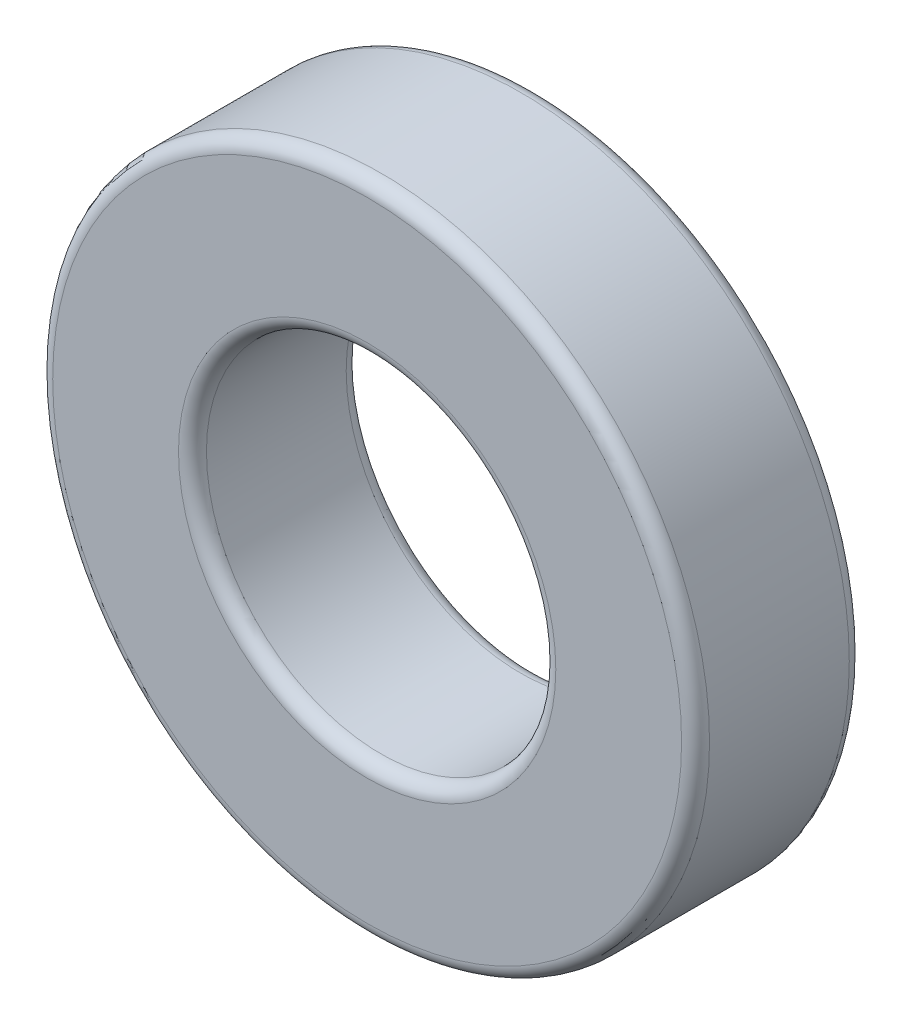
ISO-10303-21;
HEADER;
FILE_DESCRIPTION(('STEP AP214'),'2;1');
FILE_NAME('part.step','',(''),(''),'','','');
FILE_SCHEMA(('AUTOMOTIVE_DESIGN { 1 0 10303 214 1 1 1 1 }'));
ENDSEC;
DATA;
#1=APPLICATION_CONTEXT('core data for automotive mechanical design processes');
#2=APPLICATION_PROTOCOL_DEFINITION('international standard','automotive_design',2000,#1);
#3=PRODUCT_CONTEXT('',#1,'mechanical');
#4=PRODUCT('Part','Part','',(#3));
#5=PRODUCT_RELATED_PRODUCT_CATEGORY('part','',(#4));
#6=PRODUCT_DEFINITION_FORMATION('','',#4);
#7=PRODUCT_DEFINITION_CONTEXT('part definition',#1,'design');
#8=PRODUCT_DEFINITION('design','',#6,#7);
#9=PRODUCT_DEFINITION_SHAPE('','',#8);
#10=(LENGTH_UNIT() NAMED_UNIT(*) SI_UNIT(.MILLI.,.METRE.));
#11=(NAMED_UNIT(*) PLANE_ANGLE_UNIT() SI_UNIT($,.RADIAN.));
#12=(NAMED_UNIT(*) SI_UNIT($,.STERADIAN.) SOLID_ANGLE_UNIT());
#13=UNCERTAINTY_MEASURE_WITH_UNIT(LENGTH_MEASURE(1.E-05),#10,'distance_accuracy_value','');
#14=(GEOMETRIC_REPRESENTATION_CONTEXT(3) GLOBAL_UNCERTAINTY_ASSIGNED_CONTEXT((#13)) GLOBAL_UNIT_ASSIGNED_CONTEXT((#10,
#11,#12)) REPRESENTATION_CONTEXT('',''));
#15=CARTESIAN_POINT('',(0.,0.,0.));
#16=DIRECTION('',(0.,0.,1.));
#17=DIRECTION('',(1.,0.,0.));
#18=AXIS2_PLACEMENT_3D('',#15,#16,#17);
#19=CARTESIAN_POINT('',(0.,0.,12.));
#20=DIRECTION('',(0.,0.,1.));
#21=DIRECTION('',(1.,0.,0.));
#22=AXIS2_PLACEMENT_3D('',#19,#20,#21);
#23=PLANE('',#22);
#24=CARTESIAN_POINT('',(0.,0.,12.));
#25=DIRECTION('',(0.,0.,1.));
#26=DIRECTION('',(1.,0.,0.));
#27=AXIS2_PLACEMENT_3D('',#24,#25,#26);
#28=CIRCLE('',#27,13.5);
#29=CARTESIAN_POINT('',(13.5,0.,12.));
#30=VERTEX_POINT('',#29);
#31=EDGE_CURVE('E42',#30,#30,#28,.F.);
#32=ORIENTED_EDGE('',*,*,#31,.T.);
#33=EDGE_LOOP('',(#32));
#34=FACE_BOUND('',#33,.T.);
#35=CARTESIAN_POINT('',(0.,0.,12.));
#36=DIRECTION('',(0.,0.,1.));
#37=DIRECTION('',(1.,0.,0.));
#38=AXIS2_PLACEMENT_3D('',#35,#36,#37);
#39=CIRCLE('',#38,22.5);
#40=CARTESIAN_POINT('',(22.5,0.,12.));
#41=VERTEX_POINT('',#40);
#42=EDGE_CURVE('E46',#41,#41,#39,.T.);
#43=ORIENTED_EDGE('',*,*,#42,.T.);
#44=EDGE_LOOP('',(#43));
#45=FACE_BOUND('',#44,.T.);
#46=ADVANCED_FACE('F31',(#34,#45),#23,.T.);
#47=CARTESIAN_POINT('',(0.,0.,0.));
#48=DIRECTION('',(0.,0.,1.));
#49=DIRECTION('',(1.,0.,0.));
#50=AXIS2_PLACEMENT_3D('',#47,#48,#49);
#51=PLANE('',#50);
#52=CARTESIAN_POINT('',(0.,0.,0.));
#53=DIRECTION('',(0.,0.,1.));
#54=DIRECTION('',(1.,0.,0.));
#55=AXIS2_PLACEMENT_3D('',#52,#53,#54);
#56=CIRCLE('',#55,13.5);
#57=CARTESIAN_POINT('',(13.5,0.,0.));
#58=VERTEX_POINT('',#57);
#59=EDGE_CURVE('E57',#58,#58,#56,.T.);
#60=ORIENTED_EDGE('',*,*,#59,.T.);
#61=EDGE_LOOP('',(#60));
#62=FACE_BOUND('',#61,.T.);
#63=CARTESIAN_POINT('',(0.,0.,0.));
#64=DIRECTION('',(0.,0.,1.));
#65=DIRECTION('',(1.,0.,0.));
#66=AXIS2_PLACEMENT_3D('',#63,#64,#65);
#67=CIRCLE('',#66,22.5);
#68=CARTESIAN_POINT('',(22.5,0.,0.));
#69=VERTEX_POINT('',#68);
#70=EDGE_CURVE('E60',#69,#69,#67,.F.);
#71=ORIENTED_EDGE('',*,*,#70,.T.);
#72=EDGE_LOOP('',(#71));
#73=FACE_BOUND('',#72,.T.);
#74=ADVANCED_FACE('F64',(#62,#73),#51,.F.);
#75=CARTESIAN_POINT('',(0.,0.,12.));
#76=DIRECTION('',(0.,0.,-1.));
#77=DIRECTION('',(-1.,0.,0.));
#78=AXIS2_PLACEMENT_3D('',#75,#76,#77);
#79=CYLINDRICAL_SURFACE('',#78,23.5);
#80=CARTESIAN_POINT('',(0.,0.,1.));
#81=DIRECTION('',(0.,0.,1.));
#82=DIRECTION('',(1.,0.,0.));
#83=AXIS2_PLACEMENT_3D('',#80,#81,#82);
#84=CIRCLE('',#83,23.5);
#85=CARTESIAN_POINT('',(23.5,0.,1.));
#86=VERTEX_POINT('',#85);
#87=EDGE_CURVE('E10',#86,#86,#84,.T.);
#88=ORIENTED_EDGE('',*,*,#87,.T.);
#89=EDGE_LOOP('',(#88));
#90=FACE_BOUND('',#89,.T.);
#91=CARTESIAN_POINT('',(0.,0.,11.));
#92=DIRECTION('',(0.,0.,1.));
#93=DIRECTION('',(1.,0.,0.));
#94=AXIS2_PLACEMENT_3D('',#91,#92,#93);
#95=CIRCLE('',#94,23.5);
#96=CARTESIAN_POINT('',(23.5,0.,11.));
#97=VERTEX_POINT('',#96);
#98=EDGE_CURVE('E38',#97,#97,#95,.F.);
#99=ORIENTED_EDGE('',*,*,#98,.T.);
#100=EDGE_LOOP('',(#99));
#101=FACE_BOUND('',#100,.T.);
#102=ADVANCED_FACE('F84',(#90,#101),#79,.T.);
#103=CARTESIAN_POINT('',(0.,0.,12.));
#104=DIRECTION('',(0.,0.,-1.));
#105=DIRECTION('',(-1.,0.,0.));
#106=AXIS2_PLACEMENT_3D('',#103,#104,#105);
#107=CYLINDRICAL_SURFACE('',#106,12.5);
#108=CARTESIAN_POINT('',(0.,0.,1.));
#109=DIRECTION('',(0.,0.,1.));
#110=DIRECTION('',(1.,0.,0.));
#111=AXIS2_PLACEMENT_3D('',#108,#109,#110);
#112=CIRCLE('',#111,12.5);
#113=CARTESIAN_POINT('',(12.5,0.,1.));
#114=VERTEX_POINT('',#113);
#115=EDGE_CURVE('E51',#114,#114,#112,.F.);
#116=ORIENTED_EDGE('',*,*,#115,.T.);
#117=EDGE_LOOP('',(#116));
#118=FACE_BOUND('',#117,.T.);
#119=CARTESIAN_POINT('',(0.,0.,11.));
#120=DIRECTION('',(0.,0.,1.));
#121=DIRECTION('',(1.,0.,0.));
#122=AXIS2_PLACEMENT_3D('',#119,#120,#121);
#123=CIRCLE('',#122,12.5);
#124=CARTESIAN_POINT('',(12.5,0.,11.));
#125=VERTEX_POINT('',#124);
#126=EDGE_CURVE('E54',#125,#125,#123,.T.);
#127=ORIENTED_EDGE('',*,*,#126,.T.);
#128=EDGE_LOOP('',(#127));
#129=FACE_BOUND('',#128,.T.);
#130=ADVANCED_FACE('F89',(#118,#129),#107,.F.);
#131=CARTESIAN_POINT('',(0.,0.,1.));
#132=DIRECTION('',(0.,0.,1.));
#133=DIRECTION('',(1.,0.,0.));
#134=AXIS2_PLACEMENT_3D('',#131,#132,#133);
#135=TOROIDAL_SURFACE('',#134,13.5,1.);
#136=ORIENTED_EDGE('',*,*,#115,.F.);
#137=EDGE_LOOP('',(#136));
#138=FACE_BOUND('',#137,.T.);
#139=ORIENTED_EDGE('',*,*,#59,.F.);
#140=EDGE_LOOP('',(#139));
#141=FACE_BOUND('',#140,.T.);
#142=ADVANCED_FACE('F75',(#138,#141),#135,.T.);
#143=CARTESIAN_POINT('',(0.,0.,11.));
#144=DIRECTION('',(0.,0.,1.));
#145=DIRECTION('',(1.,0.,0.));
#146=AXIS2_PLACEMENT_3D('',#143,#144,#145);
#147=TOROIDAL_SURFACE('',#146,13.5,1.);
#148=ORIENTED_EDGE('',*,*,#31,.F.);
#149=EDGE_LOOP('',(#148));
#150=FACE_BOUND('',#149,.T.);
#151=ORIENTED_EDGE('',*,*,#126,.F.);
#152=EDGE_LOOP('',(#151));
#153=FACE_BOUND('',#152,.T.);
#154=ADVANCED_FACE('F69',(#150,#153),#147,.T.);
#155=CARTESIAN_POINT('',(0.,0.,1.));
#156=DIRECTION('',(0.,0.,1.));
#157=DIRECTION('',(1.,0.,0.));
#158=AXIS2_PLACEMENT_3D('',#155,#156,#157);
#159=TOROIDAL_SURFACE('',#158,22.5,1.);
#160=ORIENTED_EDGE('',*,*,#70,.F.);
#161=EDGE_LOOP('',(#160));
#162=FACE_BOUND('',#161,.T.);
#163=ORIENTED_EDGE('',*,*,#87,.F.);
#164=EDGE_LOOP('',(#163));
#165=FACE_BOUND('',#164,.T.);
#166=ADVANCED_FACE('F66',(#162,#165),#159,.T.);
#167=CARTESIAN_POINT('',(0.,0.,11.));
#168=DIRECTION('',(0.,0.,1.));
#169=DIRECTION('',(1.,0.,0.));
#170=AXIS2_PLACEMENT_3D('',#167,#168,#169);
#171=TOROIDAL_SURFACE('',#170,22.5,1.);
#172=ORIENTED_EDGE('',*,*,#98,.F.);
#173=EDGE_LOOP('',(#172));
#174=FACE_BOUND('',#173,.T.);
#175=ORIENTED_EDGE('',*,*,#42,.F.);
#176=EDGE_LOOP('',(#175));
#177=FACE_BOUND('',#176,.T.);
#178=ADVANCED_FACE('F33',(#174,#177),#171,.T.);
#179=CLOSED_SHELL('',(#46,#74,#102,#130,#142,#154,#166,#178));
#180=MANIFOLD_SOLID_BREP('B2',#179);
#181=ADVANCED_BREP_SHAPE_REPRESENTATION('',(#18,#180),#14);
#182=SHAPE_DEFINITION_REPRESENTATION(#9,#181);
ENDSEC;
END-ISO-10303-21;
